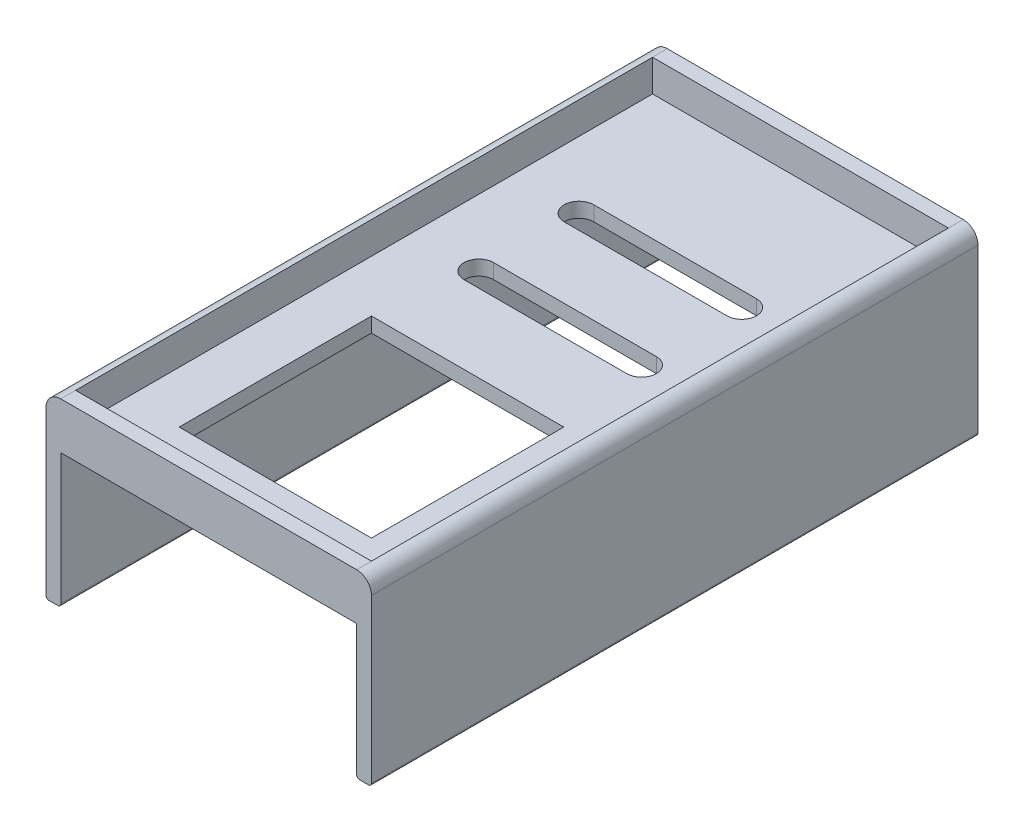
ISO-10303-21;
HEADER;
FILE_DESCRIPTION(('STEP AP214'),'2;1');
FILE_NAME('part.step','',(''),(''),'','','');
FILE_SCHEMA(('AUTOMOTIVE_DESIGN { 1 0 10303 214 1 1 1 1 }'));
ENDSEC;
DATA;
#1=APPLICATION_CONTEXT('core data for automotive mechanical design processes');
#2=APPLICATION_PROTOCOL_DEFINITION('international standard','automotive_design',2000,#1);
#3=PRODUCT_CONTEXT('',#1,'mechanical');
#4=PRODUCT('Part','Part','',(#3));
#5=PRODUCT_RELATED_PRODUCT_CATEGORY('part','',(#4));
#6=PRODUCT_DEFINITION_FORMATION('','',#4);
#7=PRODUCT_DEFINITION_CONTEXT('part definition',#1,'design');
#8=PRODUCT_DEFINITION('design','',#6,#7);
#9=PRODUCT_DEFINITION_SHAPE('','',#8);
#10=(LENGTH_UNIT() NAMED_UNIT(*) SI_UNIT(.MILLI.,.METRE.));
#11=(NAMED_UNIT(*) PLANE_ANGLE_UNIT() SI_UNIT($,.RADIAN.));
#12=(NAMED_UNIT(*) SI_UNIT($,.STERADIAN.) SOLID_ANGLE_UNIT());
#13=UNCERTAINTY_MEASURE_WITH_UNIT(LENGTH_MEASURE(1.E-05),#10,'distance_accuracy_value','');
#14=(GEOMETRIC_REPRESENTATION_CONTEXT(3) GLOBAL_UNCERTAINTY_ASSIGNED_CONTEXT((#13)) GLOBAL_UNIT_ASSIGNED_CONTEXT((#10,
#11,#12)) REPRESENTATION_CONTEXT('',''));
#15=CARTESIAN_POINT('',(0.,0.,0.));
#16=DIRECTION('',(0.,0.,1.));
#17=DIRECTION('',(1.,0.,0.));
#18=AXIS2_PLACEMENT_3D('',#15,#16,#17);
#19=CARTESIAN_POINT('',(-76.0997442455243,40.6521739130435,-410.));
#20=DIRECTION('',(0.,1.,0.));
#21=DIRECTION('',(0.,0.,1.));
#22=AXIS2_PLACEMENT_3D('',#19,#20,#21);
#23=PLANE('',#22);
#24=DIRECTION('',(0.,0.,1.));
#25=VECTOR('',#24,1.);
#26=CARTESIAN_POINT('',(133.900255754476,40.6521739130435,-600.));
#27=LINE('',#26,#25);
#28=CARTESIAN_POINT('',(133.900255754476,40.6521739130435,-410.));
#29=VERTEX_POINT('',#28);
#30=CARTESIAN_POINT('',(133.900255754476,40.6521739130435,-400.));
#31=VERTEX_POINT('',#30);
#32=EDGE_CURVE('E439',#29,#31,#27,.T.);
#33=ORIENTED_EDGE('',*,*,#32,.F.);
#34=DIRECTION('',(-1.,0.,0.));
#35=VECTOR('',#34,1.);
#36=CARTESIAN_POINT('',(-76.0997442455243,40.6521739130435,-410.));
#37=LINE('',#36,#35);
#38=CARTESIAN_POINT('',(-66.0997442455242,40.6521739130435,-410.));
#39=VERTEX_POINT('',#38);
#40=EDGE_CURVE('E277',#29,#39,#37,.T.);
#41=ORIENTED_EDGE('',*,*,#40,.T.);
#42=DIRECTION('',(0.,0.,1.));
#43=VECTOR('',#42,1.);
#44=CARTESIAN_POINT('',(-66.0997442455242,40.6521739130435,-600.));
#45=LINE('',#44,#43);
#46=CARTESIAN_POINT('',(-66.0997442455242,40.6521739130435,-400.));
#47=VERTEX_POINT('',#46);
#48=EDGE_CURVE('E438',#39,#47,#45,.T.);
#49=ORIENTED_EDGE('',*,*,#48,.T.);
#50=DIRECTION('',(1.,0.,0.));
#51=VECTOR('',#50,1.);
#52=CARTESIAN_POINT('',(0.,40.6521739130435,-400.));
#53=LINE('',#52,#51);
#54=EDGE_CURVE('E403',#47,#31,#53,.T.);
#55=ORIENTED_EDGE('',*,*,#54,.T.);
#56=EDGE_LOOP('',(#33,#41,#49,#55));
#57=FACE_BOUND('',#56,.T.);
#58=ADVANCED_FACE('F33',(#57),#23,.T.);
#59=CARTESIAN_POINT('',(-76.0997442455243,40.6521739130435,-410.));
#60=DIRECTION('',(-1.,0.,0.));
#61=DIRECTION('',(0.,-1.,0.));
#62=AXIS2_PLACEMENT_3D('',#59,#60,#61);
#63=PLANE('',#62);
#64=DIRECTION('',(0.,-1.,0.));
#65=VECTOR('',#64,1.);
#66=CARTESIAN_POINT('',(-76.0997442455243,40.6521739130435,-410.));
#67=LINE('',#66,#65);
#68=CARTESIAN_POINT('',(-76.0997442455243,30.6521739130434,-410.));
#69=VERTEX_POINT('',#68);
#70=CARTESIAN_POINT('',(-76.0997442455243,-79.3478260869565,-410.));
#71=VERTEX_POINT('',#70);
#72=EDGE_CURVE('E272',#69,#71,#67,.T.);
#73=ORIENTED_EDGE('',*,*,#72,.T.);
#74=DIRECTION('',(0.,0.,1.));
#75=VECTOR('',#74,1.);
#76=CARTESIAN_POINT('',(-76.0997442455243,-79.3478260869565,-600.));
#77=LINE('',#76,#75);
#78=CARTESIAN_POINT('',(-76.0997442455243,-79.3478260869565,0.));
#79=VERTEX_POINT('',#78);
#80=EDGE_CURVE('E493',#71,#79,#77,.T.);
#81=ORIENTED_EDGE('',*,*,#80,.T.);
#82=DIRECTION('',(0.,-1.,0.));
#83=VECTOR('',#82,1.);
#84=CARTESIAN_POINT('',(-76.0997442455243,40.6521739130435,0.));
#85=LINE('',#84,#83);
#86=CARTESIAN_POINT('',(-76.0997442455243,30.6521739130434,0.));
#87=VERTEX_POINT('',#86);
#88=EDGE_CURVE('E256',#87,#79,#85,.T.);
#89=ORIENTED_EDGE('',*,*,#88,.F.);
#90=DIRECTION('',(0.,0.,1.));
#91=VECTOR('',#90,1.);
#92=CARTESIAN_POINT('',(-76.0997442455243,30.6521739130434,-600.));
#93=LINE('',#92,#91);
#94=EDGE_CURVE('E467',#69,#87,#93,.T.);
#95=ORIENTED_EDGE('',*,*,#94,.F.);
#96=EDGE_LOOP('',(#73,#81,#89,#95));
#97=FACE_BOUND('',#96,.T.);
#98=ADVANCED_FACE('F35',(#97),#63,.T.);
#99=CARTESIAN_POINT('',(143.900255754476,40.6521739130435,-410.));
#100=DIRECTION('',(1.,0.,0.));
#101=DIRECTION('',(0.,1.,0.));
#102=AXIS2_PLACEMENT_3D('',#99,#100,#101);
#103=PLANE('',#102);
#104=DIRECTION('',(0.,0.,1.));
#105=VECTOR('',#104,1.);
#106=CARTESIAN_POINT('',(143.900255754476,-79.3478260869565,-600.));
#107=LINE('',#106,#105);
#108=CARTESIAN_POINT('',(143.900255754476,-79.3478260869565,-410.));
#109=VERTEX_POINT('',#108);
#110=CARTESIAN_POINT('',(143.900255754476,-79.3478260869565,0.));
#111=VERTEX_POINT('',#110);
#112=EDGE_CURVE('E470',#109,#111,#107,.T.);
#113=ORIENTED_EDGE('',*,*,#112,.F.);
#114=DIRECTION('',(0.,1.,0.));
#115=VECTOR('',#114,1.);
#116=CARTESIAN_POINT('',(143.900255754476,40.6521739130435,-410.));
#117=LINE('',#116,#115);
#118=CARTESIAN_POINT('',(143.900255754476,30.6521739130434,-410.));
#119=VERTEX_POINT('',#118);
#120=EDGE_CURVE('E431',#109,#119,#117,.T.);
#121=ORIENTED_EDGE('',*,*,#120,.T.);
#122=DIRECTION('',(0.,0.,1.));
#123=VECTOR('',#122,1.);
#124=CARTESIAN_POINT('',(143.900255754476,30.6521739130434,-600.));
#125=LINE('',#124,#123);
#126=CARTESIAN_POINT('',(143.900255754476,30.6521739130434,0.));
#127=VERTEX_POINT('',#126);
#128=EDGE_CURVE('E477',#119,#127,#125,.T.);
#129=ORIENTED_EDGE('',*,*,#128,.T.);
#130=DIRECTION('',(0.,1.,0.));
#131=VECTOR('',#130,1.);
#132=CARTESIAN_POINT('',(143.900255754476,40.6521739130435,0.));
#133=LINE('',#132,#131);
#134=EDGE_CURVE('E266',#111,#127,#133,.T.);
#135=ORIENTED_EDGE('',*,*,#134,.F.);
#136=EDGE_LOOP('',(#113,#121,#129,#135));
#137=FACE_BOUND('',#136,.T.);
#138=ADVANCED_FACE('F472',(#137),#103,.T.);
#139=CARTESIAN_POINT('',(0.,0.,-410.));
#140=DIRECTION('',(0.,0.,1.));
#141=DIRECTION('',(1.,0.,0.));
#142=AXIS2_PLACEMENT_3D('',#139,#140,#141);
#143=PLANE('',#142);
#144=CARTESIAN_POINT('',(-74.0997442455243,-79.3478260869565,-410.));
#145=DIRECTION('',(0.,0.,1.));
#146=DIRECTION('',(1.,0.,0.));
#147=AXIS2_PLACEMENT_3D('',#144,#145,#146);
#148=CIRCLE('',#147,2.);
#149=CARTESIAN_POINT('',(-74.0997442455243,-81.3478260869565,-410.));
#150=VERTEX_POINT('',#149);
#151=EDGE_CURVE('E461',#71,#150,#148,.T.);
#152=ORIENTED_EDGE('',*,*,#151,.F.);
#153=ORIENTED_EDGE('',*,*,#72,.F.);
#154=CARTESIAN_POINT('',(-66.0997442455243,30.6521739130435,-410.));
#155=DIRECTION('',(0.,0.,1.));
#156=DIRECTION('',(1.,0.,0.));
#157=AXIS2_PLACEMENT_3D('',#154,#155,#156);
#158=CIRCLE('',#157,10.);
#159=EDGE_CURVE('E448',#69,#39,#158,.F.);
#160=ORIENTED_EDGE('',*,*,#159,.T.);
#161=ORIENTED_EDGE('',*,*,#40,.F.);
#162=CARTESIAN_POINT('',(133.900255754476,30.6521739130435,-410.));
#163=DIRECTION('',(0.,0.,1.));
#164=DIRECTION('',(1.,0.,0.));
#165=AXIS2_PLACEMENT_3D('',#162,#163,#164);
#166=CIRCLE('',#165,10.);
#167=EDGE_CURVE('E446',#119,#29,#166,.T.);
#168=ORIENTED_EDGE('',*,*,#167,.F.);
#169=ORIENTED_EDGE('',*,*,#120,.F.);
#170=CARTESIAN_POINT('',(141.900255754476,-79.3478260869565,-410.));
#171=DIRECTION('',(0.,0.,1.));
#172=DIRECTION('',(1.,0.,0.));
#173=AXIS2_PLACEMENT_3D('',#170,#171,#172);
#174=CIRCLE('',#173,2.);
#175=CARTESIAN_POINT('',(141.900255754476,-81.3478260869565,-410.));
#176=VERTEX_POINT('',#175);
#177=EDGE_CURVE('E453',#176,#109,#174,.T.);
#178=ORIENTED_EDGE('',*,*,#177,.F.);
#179=DIRECTION('',(1.,0.,0.));
#180=VECTOR('',#179,1.);
#181=CARTESIAN_POINT('',(143.900255754476,-81.3478260869565,-410.));
#182=LINE('',#181,#180);
#183=CARTESIAN_POINT('',(135.900255754476,-81.3478260869565,-410.));
#184=VERTEX_POINT('',#183);
#185=EDGE_CURVE('E287',#184,#176,#182,.T.);
#186=ORIENTED_EDGE('',*,*,#185,.F.);
#187=CARTESIAN_POINT('',(135.900255754476,-79.3478260869565,-410.));
#188=DIRECTION('',(0.,0.,1.));
#189=DIRECTION('',(1.,0.,0.));
#190=AXIS2_PLACEMENT_3D('',#187,#188,#189);
#191=CIRCLE('',#190,2.);
#192=CARTESIAN_POINT('',(133.900255754476,-79.3478260869565,-410.));
#193=VERTEX_POINT('',#192);
#194=EDGE_CURVE('E48',#184,#193,#191,.F.);
#195=ORIENTED_EDGE('',*,*,#194,.T.);
#196=DIRECTION('',(0.,-1.,0.));
#197=VECTOR('',#196,1.);
#198=CARTESIAN_POINT('',(133.900255754476,-79.3478260869565,-410.));
#199=LINE('',#198,#197);
#200=CARTESIAN_POINT('',(133.900255754476,9.15217391304349,-410.));
#201=VERTEX_POINT('',#200);
#202=EDGE_CURVE('E428',#201,#193,#199,.T.);
#203=ORIENTED_EDGE('',*,*,#202,.F.);
#204=DIRECTION('',(1.,0.,0.));
#205=VECTOR('',#204,1.);
#206=CARTESIAN_POINT('',(133.900255754476,9.15217391304349,-410.));
#207=LINE('',#206,#205);
#208=CARTESIAN_POINT('',(-66.0997442455243,9.15217391304349,-410.));
#209=VERTEX_POINT('',#208);
#210=EDGE_CURVE('E425',#209,#201,#207,.T.);
#211=ORIENTED_EDGE('',*,*,#210,.F.);
#212=DIRECTION('',(0.,1.,0.));
#213=VECTOR('',#212,1.);
#214=CARTESIAN_POINT('',(-66.0997442455243,-79.3478260869565,-410.));
#215=LINE('',#214,#213);
#216=CARTESIAN_POINT('',(-66.0997442455243,-79.3478260869565,-410.));
#217=VERTEX_POINT('',#216);
#218=EDGE_CURVE('E423',#217,#209,#215,.T.);
#219=ORIENTED_EDGE('',*,*,#218,.F.);
#220=CARTESIAN_POINT('',(-68.0997442455243,-79.3478260869565,-410.));
#221=DIRECTION('',(0.,0.,1.));
#222=DIRECTION('',(1.,0.,0.));
#223=AXIS2_PLACEMENT_3D('',#220,#221,#222);
#224=CIRCLE('',#223,2.);
#225=CARTESIAN_POINT('',(-68.0997442455243,-81.3478260869565,-410.));
#226=VERTEX_POINT('',#225);
#227=EDGE_CURVE('E234',#226,#217,#224,.T.);
#228=ORIENTED_EDGE('',*,*,#227,.F.);
#229=DIRECTION('',(1.,0.,0.));
#230=VECTOR('',#229,1.);
#231=CARTESIAN_POINT('',(-66.0997442455243,-81.3478260869565,-410.));
#232=LINE('',#231,#230);
#233=EDGE_CURVE('E292',#150,#226,#232,.T.);
#234=ORIENTED_EDGE('',*,*,#233,.F.);
#235=EDGE_LOOP('',(#152,#153,#160,#161,#168,#169,#178,#186,#195,#203,#211,#219,#228,#234));
#236=FACE_BOUND('',#235,.T.);
#237=ADVANCED_FACE('F444',(#236),#143,.F.);
#238=CARTESIAN_POINT('',(0.,0.,0.));
#239=DIRECTION('',(0.,0.,1.));
#240=DIRECTION('',(1.,0.,0.));
#241=AXIS2_PLACEMENT_3D('',#238,#239,#240);
#242=PLANE('',#241);
#243=ORIENTED_EDGE('',*,*,#88,.T.);
#244=CARTESIAN_POINT('',(-74.0997442455243,-79.3478260869565,0.));
#245=DIRECTION('',(0.,0.,1.));
#246=DIRECTION('',(1.,0.,0.));
#247=AXIS2_PLACEMENT_3D('',#244,#245,#246);
#248=CIRCLE('',#247,2.);
#249=CARTESIAN_POINT('',(-74.0997442455243,-81.3478260869565,0.));
#250=VERTEX_POINT('',#249);
#251=EDGE_CURVE('E238',#79,#250,#248,.T.);
#252=ORIENTED_EDGE('',*,*,#251,.T.);
#253=DIRECTION('',(-1.,0.,0.));
#254=VECTOR('',#253,1.);
#255=CARTESIAN_POINT('',(-66.0997442455243,-81.3478260869565,0.));
#256=LINE('',#255,#254);
#257=CARTESIAN_POINT('',(-68.0997442455243,-81.3478260869565,0.));
#258=VERTEX_POINT('',#257);
#259=EDGE_CURVE('E249',#258,#250,#256,.T.);
#260=ORIENTED_EDGE('',*,*,#259,.F.);
#261=CARTESIAN_POINT('',(-68.0997442455243,-79.3478260869565,0.));
#262=DIRECTION('',(0.,0.,1.));
#263=DIRECTION('',(1.,0.,0.));
#264=AXIS2_PLACEMENT_3D('',#261,#262,#263);
#265=CIRCLE('',#264,2.);
#266=CARTESIAN_POINT('',(-66.0997442455243,-79.3478260869565,0.));
#267=VERTEX_POINT('',#266);
#268=EDGE_CURVE('E231',#258,#267,#265,.T.);
#269=ORIENTED_EDGE('',*,*,#268,.T.);
#270=DIRECTION('',(0.,1.,0.));
#271=VECTOR('',#270,1.);
#272=CARTESIAN_POINT('',(-66.0997442455243,-79.3478260869565,0.));
#273=LINE('',#272,#271);
#274=CARTESIAN_POINT('',(-66.0997442455243,9.15217391304349,0.));
#275=VERTEX_POINT('',#274);
#276=EDGE_CURVE('E245',#267,#275,#273,.T.);
#277=ORIENTED_EDGE('',*,*,#276,.T.);
#278=DIRECTION('',(1.,0.,0.));
#279=VECTOR('',#278,1.);
#280=CARTESIAN_POINT('',(133.900255754476,9.15217391304349,0.));
#281=LINE('',#280,#279);
#282=CARTESIAN_POINT('',(133.900255754476,9.15217391304349,0.));
#283=VERTEX_POINT('',#282);
#284=EDGE_CURVE('E255',#275,#283,#281,.T.);
#285=ORIENTED_EDGE('',*,*,#284,.T.);
#286=DIRECTION('',(0.,-1.,0.));
#287=VECTOR('',#286,1.);
#288=CARTESIAN_POINT('',(133.900255754476,-79.3478260869565,0.));
#289=LINE('',#288,#287);
#290=CARTESIAN_POINT('',(133.900255754476,-79.3478260869565,0.));
#291=VERTEX_POINT('',#290);
#292=EDGE_CURVE('E258',#283,#291,#289,.T.);
#293=ORIENTED_EDGE('',*,*,#292,.T.);
#294=CARTESIAN_POINT('',(135.900255754476,-79.3478260869565,0.));
#295=DIRECTION('',(0.,0.,1.));
#296=DIRECTION('',(1.,0.,0.));
#297=AXIS2_PLACEMENT_3D('',#294,#295,#296);
#298=CIRCLE('',#297,2.);
#299=CARTESIAN_POINT('',(135.900255754476,-81.3478260869565,0.));
#300=VERTEX_POINT('',#299);
#301=EDGE_CURVE('E291',#300,#291,#298,.F.);
#302=ORIENTED_EDGE('',*,*,#301,.F.);
#303=DIRECTION('',(-1.,0.,0.));
#304=VECTOR('',#303,1.);
#305=CARTESIAN_POINT('',(143.900255754476,-81.3478260869565,0.));
#306=LINE('',#305,#304);
#307=CARTESIAN_POINT('',(141.900255754476,-81.3478260869565,0.));
#308=VERTEX_POINT('',#307);
#309=EDGE_CURVE('E285',#308,#300,#306,.T.);
#310=ORIENTED_EDGE('',*,*,#309,.F.);
#311=CARTESIAN_POINT('',(141.900255754476,-79.3478260869565,0.));
#312=DIRECTION('',(0.,0.,1.));
#313=DIRECTION('',(1.,0.,0.));
#314=AXIS2_PLACEMENT_3D('',#311,#312,#313);
#315=CIRCLE('',#314,2.);
#316=EDGE_CURVE('E55',#308,#111,#315,.T.);
#317=ORIENTED_EDGE('',*,*,#316,.T.);
#318=ORIENTED_EDGE('',*,*,#134,.T.);
#319=CARTESIAN_POINT('',(133.900255754476,30.6521739130435,0.));
#320=DIRECTION('',(0.,0.,1.));
#321=DIRECTION('',(1.,0.,0.));
#322=AXIS2_PLACEMENT_3D('',#319,#320,#321);
#323=CIRCLE('',#322,10.);
#324=CARTESIAN_POINT('',(133.900255754476,40.6521739130435,0.));
#325=VERTEX_POINT('',#324);
#326=EDGE_CURVE('E474',#127,#325,#323,.T.);
#327=ORIENTED_EDGE('',*,*,#326,.T.);
#328=DIRECTION('',(-1.,0.,0.));
#329=VECTOR('',#328,1.);
#330=CARTESIAN_POINT('',(-76.0997442455243,40.6521739130435,0.));
#331=LINE('',#330,#329);
#332=CARTESIAN_POINT('',(-66.0997442455242,40.6521739130435,0.));
#333=VERTEX_POINT('',#332);
#334=EDGE_CURVE('E269',#325,#333,#331,.T.);
#335=ORIENTED_EDGE('',*,*,#334,.T.);
#336=CARTESIAN_POINT('',(-66.0997442455243,30.6521739130435,0.));
#337=DIRECTION('',(0.,0.,1.));
#338=DIRECTION('',(1.,0.,0.));
#339=AXIS2_PLACEMENT_3D('',#336,#337,#338);
#340=CIRCLE('',#339,10.);
#341=EDGE_CURVE('E483',#87,#333,#340,.F.);
#342=ORIENTED_EDGE('',*,*,#341,.F.);
#343=EDGE_LOOP('',(#243,#252,#260,#269,#277,#285,#293,#302,#310,#317,#318,#327,#335,#342));
#344=FACE_BOUND('',#343,.T.);
#345=ADVANCED_FACE('F243',(#344),#242,.T.);
#346=CARTESIAN_POINT('',(0.,-81.3478260869565,0.));
#347=DIRECTION('',(0.,-1.,0.));
#348=DIRECTION('',(0.,0.,-1.));
#349=AXIS2_PLACEMENT_3D('',#346,#347,#348);
#350=PLANE('',#349);
#351=ORIENTED_EDGE('',*,*,#309,.T.);
#352=DIRECTION('',(0.,0.,1.));
#353=VECTOR('',#352,1.);
#354=CARTESIAN_POINT('',(135.900255754476,-81.3478260869565,-600.));
#355=LINE('',#354,#353);
#356=EDGE_CURVE('E11',#300,#184,#355,.F.);
#357=ORIENTED_EDGE('',*,*,#356,.T.);
#358=ORIENTED_EDGE('',*,*,#185,.T.);
#359=DIRECTION('',(0.,0.,1.));
#360=VECTOR('',#359,1.);
#361=CARTESIAN_POINT('',(141.900255754476,-81.3478260869565,-600.));
#362=LINE('',#361,#360);
#363=EDGE_CURVE('E41',#176,#308,#362,.T.);
#364=ORIENTED_EDGE('',*,*,#363,.T.);
#365=EDGE_LOOP('',(#351,#357,#358,#364));
#366=FACE_BOUND('',#365,.T.);
#367=ADVANCED_FACE('F284',(#366),#350,.T.);
#368=CARTESIAN_POINT('',(0.,-81.3478260869565,0.));
#369=DIRECTION('',(0.,-1.,0.));
#370=DIRECTION('',(0.,0.,-1.));
#371=AXIS2_PLACEMENT_3D('',#368,#369,#370);
#372=PLANE('',#371);
#373=DIRECTION('',(0.,0.,1.));
#374=VECTOR('',#373,1.);
#375=CARTESIAN_POINT('',(-74.0997442455243,-81.3478260869565,-600.));
#376=LINE('',#375,#374);
#377=EDGE_CURVE('E279',#150,#250,#376,.T.);
#378=ORIENTED_EDGE('',*,*,#377,.F.);
#379=ORIENTED_EDGE('',*,*,#233,.T.);
#380=DIRECTION('',(0.,0.,1.));
#381=VECTOR('',#380,1.);
#382=CARTESIAN_POINT('',(-68.0997442455243,-81.3478260869565,-600.));
#383=LINE('',#382,#381);
#384=EDGE_CURVE('E275',#226,#258,#383,.T.);
#385=ORIENTED_EDGE('',*,*,#384,.T.);
#386=ORIENTED_EDGE('',*,*,#259,.T.);
#387=EDGE_LOOP('',(#378,#379,#385,#386));
#388=FACE_BOUND('',#387,.T.);
#389=ADVANCED_FACE('F458',(#388),#372,.T.);
#390=CARTESIAN_POINT('',(133.900255754476,40.6521739130435,-10.));
#391=VERTEX_POINT('',#390);
#392=EDGE_CURVE('E500',#391,#325,#27,.T.);
#393=ORIENTED_EDGE('',*,*,#392,.F.);
#394=DIRECTION('',(1.,0.,0.));
#395=VECTOR('',#394,1.);
#396=CARTESIAN_POINT('',(0.,40.6521739130435,-9.99999999999997));
#397=LINE('',#396,#395);
#398=CARTESIAN_POINT('',(-66.0997442455243,40.6521739130435,-9.99999999999997));
#399=VERTEX_POINT('',#398);
#400=EDGE_CURVE('E393',#399,#391,#397,.T.);
#401=ORIENTED_EDGE('',*,*,#400,.F.);
#402=EDGE_CURVE('E464',#399,#333,#45,.T.);
#403=ORIENTED_EDGE('',*,*,#402,.T.);
#404=ORIENTED_EDGE('',*,*,#334,.F.);
#405=EDGE_LOOP('',(#393,#401,#403,#404));
#406=FACE_BOUND('',#405,.T.);
#407=ADVANCED_FACE('F503',(#406),#23,.T.);
#408=CARTESIAN_POINT('',(133.900255754476,-79.3478260869565,-410.));
#409=DIRECTION('',(-1.,0.,0.));
#410=DIRECTION('',(0.,0.,1.));
#411=AXIS2_PLACEMENT_3D('',#408,#409,#410);
#412=PLANE('',#411);
#413=DIRECTION('',(0.,0.,1.));
#414=VECTOR('',#413,1.);
#415=CARTESIAN_POINT('',(133.900255754476,-79.3478260869565,-600.));
#416=LINE('',#415,#414);
#417=EDGE_CURVE('E479',#193,#291,#416,.T.);
#418=ORIENTED_EDGE('',*,*,#417,.T.);
#419=ORIENTED_EDGE('',*,*,#292,.F.);
#420=DIRECTION('',(0.,0.,1.));
#421=VECTOR('',#420,1.);
#422=CARTESIAN_POINT('',(133.900255754476,9.15217391304349,-410.));
#423=LINE('',#422,#421);
#424=EDGE_CURVE('E273',#201,#283,#423,.T.);
#425=ORIENTED_EDGE('',*,*,#424,.F.);
#426=ORIENTED_EDGE('',*,*,#202,.T.);
#427=EDGE_LOOP('',(#418,#419,#425,#426));
#428=FACE_BOUND('',#427,.T.);
#429=ADVANCED_FACE('F546',(#428),#412,.T.);
#430=CARTESIAN_POINT('',(133.900255754476,9.15217391304349,-410.));
#431=DIRECTION('',(0.,-1.,0.));
#432=DIRECTION('',(0.,0.,-1.));
#433=AXIS2_PLACEMENT_3D('',#430,#431,#432);
#434=PLANE('',#433);
#435=DIRECTION('',(-1.,0.,0.));
#436=VECTOR('',#435,1.);
#437=CARTESIAN_POINT('',(133.900255754476,9.15217391304349,-45.));
#438=LINE('',#437,#436);
#439=CARTESIAN_POINT('',(98.9002557544757,9.15217391304349,-45.));
#440=VERTEX_POINT('',#439);
#441=CARTESIAN_POINT('',(-31.0997442455243,9.15217391304349,-45.));
#442=VERTEX_POINT('',#441);
#443=EDGE_CURVE('E387',#440,#442,#438,.T.);
#444=ORIENTED_EDGE('',*,*,#443,.F.);
#445=DIRECTION('',(0.,0.,-1.));
#446=VECTOR('',#445,1.);
#447=CARTESIAN_POINT('',(98.9002557544757,9.15217391304349,-410.));
#448=LINE('',#447,#446);
#449=CARTESIAN_POINT('',(98.9002557544757,9.15217391304349,-175.));
#450=VERTEX_POINT('',#449);
#451=EDGE_CURVE('E379',#440,#450,#448,.T.);
#452=ORIENTED_EDGE('',*,*,#451,.T.);
#453=DIRECTION('',(-1.,0.,0.));
#454=VECTOR('',#453,1.);
#455=CARTESIAN_POINT('',(133.900255754476,9.15217391304349,-175.));
#456=LINE('',#455,#454);
#457=CARTESIAN_POINT('',(-31.0997442455243,9.15217391304349,-175.));
#458=VERTEX_POINT('',#457);
#459=EDGE_CURVE('E382',#450,#458,#456,.T.);
#460=ORIENTED_EDGE('',*,*,#459,.T.);
#461=DIRECTION('',(0.,0.,-1.));
#462=VECTOR('',#461,1.);
#463=CARTESIAN_POINT('',(-31.0997442455243,9.15217391304349,-410.));
#464=LINE('',#463,#462);
#465=EDGE_CURVE('E385',#442,#458,#464,.T.);
#466=ORIENTED_EDGE('',*,*,#465,.F.);
#467=EDGE_LOOP('',(#444,#452,#460,#466));
#468=FACE_BOUND('',#467,.T.);
#469=CARTESIAN_POINT('',(-21.0997442455243,9.15217391304349,-237.552781264335));
#470=DIRECTION('',(0.,-1.,0.));
#471=DIRECTION('',(0.,0.,-1.));
#472=AXIS2_PLACEMENT_3D('',#469,#470,#471);
#473=CIRCLE('',#472,10.);
#474=CARTESIAN_POINT('',(-21.0997442455243,9.15217391304349,-227.552781264335));
#475=VERTEX_POINT('',#474);
#476=CARTESIAN_POINT('',(-21.0997442455243,9.15217391304349,-247.552781264335));
#477=VERTEX_POINT('',#476);
#478=EDGE_CURVE('E377',#475,#477,#473,.T.);
#479=ORIENTED_EDGE('',*,*,#478,.F.);
#480=DIRECTION('',(-1.,0.,0.));
#481=VECTOR('',#480,1.);
#482=CARTESIAN_POINT('',(133.900255754476,9.15217391304349,-227.552781264335));
#483=LINE('',#482,#481);
#484=CARTESIAN_POINT('',(88.9002557544757,9.15217391304349,-227.552781264335));
#485=VERTEX_POINT('',#484);
#486=EDGE_CURVE('E369',#485,#475,#483,.T.);
#487=ORIENTED_EDGE('',*,*,#486,.F.);
#488=CARTESIAN_POINT('',(88.9002557544757,9.15217391304349,-237.552781264335));
#489=DIRECTION('',(0.,-1.,0.));
#490=DIRECTION('',(0.,0.,-1.));
#491=AXIS2_PLACEMENT_3D('',#488,#489,#490);
#492=CIRCLE('',#491,10.);
#493=CARTESIAN_POINT('',(88.9002557544757,9.15217391304349,-247.552781264335));
#494=VERTEX_POINT('',#493);
#495=EDGE_CURVE('E371',#494,#485,#492,.T.);
#496=ORIENTED_EDGE('',*,*,#495,.F.);
#497=DIRECTION('',(-1.,0.,0.));
#498=VECTOR('',#497,1.);
#499=CARTESIAN_POINT('',(133.900255754476,9.15217391304349,-247.552781264335));
#500=LINE('',#499,#498);
#501=EDGE_CURVE('E374',#494,#477,#500,.T.);
#502=ORIENTED_EDGE('',*,*,#501,.T.);
#503=EDGE_LOOP('',(#479,#487,#496,#502));
#504=FACE_BOUND('',#503,.T.);
#505=CARTESIAN_POINT('',(-21.0997442455243,9.15217391304349,-305.266550996848));
#506=DIRECTION('',(0.,-1.,0.));
#507=DIRECTION('',(0.,0.,-1.));
#508=AXIS2_PLACEMENT_3D('',#505,#506,#507);
#509=CIRCLE('',#508,10.);
#510=CARTESIAN_POINT('',(-21.0997442455243,9.15217391304349,-295.266550996848));
#511=VERTEX_POINT('',#510);
#512=CARTESIAN_POINT('',(-21.0997442455243,9.15217391304349,-315.266550996848));
#513=VERTEX_POINT('',#512);
#514=EDGE_CURVE('E367',#511,#513,#509,.T.);
#515=ORIENTED_EDGE('',*,*,#514,.F.);
#516=DIRECTION('',(-1.,0.,0.));
#517=VECTOR('',#516,1.);
#518=CARTESIAN_POINT('',(133.900255754476,9.15217391304349,-295.266550996848));
#519=LINE('',#518,#517);
#520=CARTESIAN_POINT('',(88.9002557544757,9.15217391304349,-295.266550996848));
#521=VERTEX_POINT('',#520);
#522=EDGE_CURVE('E315',#521,#511,#519,.T.);
#523=ORIENTED_EDGE('',*,*,#522,.F.);
#524=CARTESIAN_POINT('',(88.9002557544757,9.15217391304349,-305.266550996848));
#525=DIRECTION('',(0.,-1.,0.));
#526=DIRECTION('',(0.,0.,-1.));
#527=AXIS2_PLACEMENT_3D('',#524,#525,#526);
#528=CIRCLE('',#527,10.);
#529=CARTESIAN_POINT('',(88.9002557544757,9.15217391304349,-315.266550996848));
#530=VERTEX_POINT('',#529);
#531=EDGE_CURVE('E361',#530,#521,#528,.T.);
#532=ORIENTED_EDGE('',*,*,#531,.F.);
#533=DIRECTION('',(-1.,0.,0.));
#534=VECTOR('',#533,1.);
#535=CARTESIAN_POINT('',(133.900255754476,9.15217391304349,-315.266550996848));
#536=LINE('',#535,#534);
#537=EDGE_CURVE('E364',#530,#513,#536,.T.);
#538=ORIENTED_EDGE('',*,*,#537,.T.);
#539=EDGE_LOOP('',(#515,#523,#532,#538));
#540=FACE_BOUND('',#539,.T.);
#541=ORIENTED_EDGE('',*,*,#284,.F.);
#542=DIRECTION('',(0.,0.,1.));
#543=VECTOR('',#542,1.);
#544=CARTESIAN_POINT('',(-66.0997442455243,9.15217391304349,-410.));
#545=LINE('',#544,#543);
#546=EDGE_CURVE('E253',#209,#275,#545,.T.);
#547=ORIENTED_EDGE('',*,*,#546,.F.);
#548=ORIENTED_EDGE('',*,*,#210,.T.);
#549=ORIENTED_EDGE('',*,*,#424,.T.);
#550=EDGE_LOOP('',(#541,#547,#548,#549));
#551=FACE_BOUND('',#550,.T.);
#552=ADVANCED_FACE('F551',(#468,#504,#540,#551),#434,.T.);
#553=CARTESIAN_POINT('',(-66.0997442455243,-79.3478260869565,-410.));
#554=DIRECTION('',(1.,0.,0.));
#555=DIRECTION('',(0.,0.,-1.));
#556=AXIS2_PLACEMENT_3D('',#553,#554,#555);
#557=PLANE('',#556);
#558=DIRECTION('',(0.,0.,1.));
#559=VECTOR('',#558,1.);
#560=CARTESIAN_POINT('',(-66.0997442455243,-79.3478260869565,-600.));
#561=LINE('',#560,#559);
#562=EDGE_CURVE('E228',#217,#267,#561,.T.);
#563=ORIENTED_EDGE('',*,*,#562,.F.);
#564=ORIENTED_EDGE('',*,*,#218,.T.);
#565=ORIENTED_EDGE('',*,*,#546,.T.);
#566=ORIENTED_EDGE('',*,*,#276,.F.);
#567=EDGE_LOOP('',(#563,#564,#565,#566));
#568=FACE_BOUND('',#567,.T.);
#569=ADVANCED_FACE('F251',(#568),#557,.T.);
#570=CARTESIAN_POINT('',(133.900255754476,19.1521739130435,0.));
#571=DIRECTION('',(-1.,0.,0.));
#572=DIRECTION('',(0.,0.,1.));
#573=AXIS2_PLACEMENT_3D('',#570,#571,#572);
#574=PLANE('',#573);
#575=DIRECTION('',(0.,0.,1.));
#576=VECTOR('',#575,1.);
#577=CARTESIAN_POINT('',(133.900255754476,40.6521739130435,0.));
#578=LINE('',#577,#576);
#579=EDGE_CURVE('E389',#31,#391,#578,.T.);
#580=ORIENTED_EDGE('',*,*,#579,.F.);
#581=DIRECTION('',(0.,1.,0.));
#582=VECTOR('',#581,1.);
#583=CARTESIAN_POINT('',(133.900255754476,19.1521739130435,-400.));
#584=LINE('',#583,#582);
#585=CARTESIAN_POINT('',(133.900255754476,19.1521739130435,-400.));
#586=VERTEX_POINT('',#585);
#587=EDGE_CURVE('E401',#586,#31,#584,.T.);
#588=ORIENTED_EDGE('',*,*,#587,.F.);
#589=DIRECTION('',(0.,0.,1.));
#590=VECTOR('',#589,1.);
#591=CARTESIAN_POINT('',(133.900255754476,19.1521739130435,0.));
#592=LINE('',#591,#590);
#593=CARTESIAN_POINT('',(133.900255754476,19.1521739130435,-9.99999999999997));
#594=VERTEX_POINT('',#593);
#595=EDGE_CURVE('E390',#586,#594,#592,.T.);
#596=ORIENTED_EDGE('',*,*,#595,.T.);
#597=DIRECTION('',(0.,1.,0.));
#598=VECTOR('',#597,1.);
#599=CARTESIAN_POINT('',(133.900255754476,19.1521739130435,-9.99999999999997));
#600=LINE('',#599,#598);
#601=EDGE_CURVE('E260',#594,#391,#600,.T.);
#602=ORIENTED_EDGE('',*,*,#601,.T.);
#603=EDGE_LOOP('',(#580,#588,#596,#602));
#604=FACE_BOUND('',#603,.T.);
#605=ADVANCED_FACE('F507',(#604),#574,.T.);
#606=CARTESIAN_POINT('',(0.,19.1521739130435,-9.99999999999997));
#607=DIRECTION('',(0.,0.,1.));
#608=DIRECTION('',(1.,0.,0.));
#609=AXIS2_PLACEMENT_3D('',#606,#607,#608);
#610=PLANE('',#609);
#611=ORIENTED_EDGE('',*,*,#400,.T.);
#612=ORIENTED_EDGE('',*,*,#601,.F.);
#613=DIRECTION('',(1.,0.,0.));
#614=VECTOR('',#613,1.);
#615=CARTESIAN_POINT('',(0.,19.1521739130435,-9.99999999999997));
#616=LINE('',#615,#614);
#617=CARTESIAN_POINT('',(-66.0997442455243,19.1521739130435,-9.99999999999997));
#618=VERTEX_POINT('',#617);
#619=EDGE_CURVE('E398',#618,#594,#616,.T.);
#620=ORIENTED_EDGE('',*,*,#619,.F.);
#621=DIRECTION('',(0.,1.,0.));
#622=VECTOR('',#621,1.);
#623=CARTESIAN_POINT('',(-66.0997442455243,19.1521739130435,-9.99999999999997));
#624=LINE('',#623,#622);
#625=EDGE_CURVE('E413',#618,#399,#624,.T.);
#626=ORIENTED_EDGE('',*,*,#625,.T.);
#627=EDGE_LOOP('',(#611,#612,#620,#626));
#628=FACE_BOUND('',#627,.T.);
#629=ADVANCED_FACE('F512',(#628),#610,.F.);
#630=CARTESIAN_POINT('',(-66.0997442455243,19.1521739130435,0.));
#631=DIRECTION('',(-1.,0.,0.));
#632=DIRECTION('',(0.,0.,1.));
#633=AXIS2_PLACEMENT_3D('',#630,#631,#632);
#634=PLANE('',#633);
#635=DIRECTION('',(0.,0.,1.));
#636=VECTOR('',#635,1.);
#637=CARTESIAN_POINT('',(-66.0997442455243,40.6521739130435,0.));
#638=LINE('',#637,#636);
#639=EDGE_CURVE('E406',#47,#399,#638,.T.);
#640=ORIENTED_EDGE('',*,*,#639,.T.);
#641=ORIENTED_EDGE('',*,*,#625,.F.);
#642=DIRECTION('',(0.,0.,1.));
#643=VECTOR('',#642,1.);
#644=CARTESIAN_POINT('',(-66.0997442455243,19.1521739130435,0.));
#645=LINE('',#644,#643);
#646=CARTESIAN_POINT('',(-66.0997442455243,19.1521739130435,-400.));
#647=VERTEX_POINT('',#646);
#648=EDGE_CURVE('E395',#647,#618,#645,.T.);
#649=ORIENTED_EDGE('',*,*,#648,.F.);
#650=DIRECTION('',(0.,1.,0.));
#651=VECTOR('',#650,1.);
#652=CARTESIAN_POINT('',(-66.0997442455243,19.1521739130435,-400.));
#653=LINE('',#652,#651);
#654=EDGE_CURVE('E416',#647,#47,#653,.T.);
#655=ORIENTED_EDGE('',*,*,#654,.T.);
#656=EDGE_LOOP('',(#640,#641,#649,#655));
#657=FACE_BOUND('',#656,.T.);
#658=ADVANCED_FACE('F515',(#657),#634,.F.);
#659=CARTESIAN_POINT('',(0.,19.1521739130435,-400.));
#660=DIRECTION('',(0.,0.,1.));
#661=DIRECTION('',(1.,0.,0.));
#662=AXIS2_PLACEMENT_3D('',#659,#660,#661);
#663=PLANE('',#662);
#664=ORIENTED_EDGE('',*,*,#54,.F.);
#665=ORIENTED_EDGE('',*,*,#654,.F.);
#666=DIRECTION('',(1.,0.,0.));
#667=VECTOR('',#666,1.);
#668=CARTESIAN_POINT('',(0.,19.1521739130435,-400.));
#669=LINE('',#668,#667);
#670=EDGE_CURVE('E392',#647,#586,#669,.T.);
#671=ORIENTED_EDGE('',*,*,#670,.T.);
#672=ORIENTED_EDGE('',*,*,#587,.T.);
#673=EDGE_LOOP('',(#664,#665,#671,#672));
#674=FACE_BOUND('',#673,.T.);
#675=ADVANCED_FACE('F519',(#674),#663,.T.);
#676=CARTESIAN_POINT('',(0.,19.1521739130435,0.));
#677=DIRECTION('',(0.,1.,0.));
#678=DIRECTION('',(0.,0.,1.));
#679=AXIS2_PLACEMENT_3D('',#676,#677,#678);
#680=PLANE('',#679);
#681=DIRECTION('',(1.,0.,0.));
#682=VECTOR('',#681,1.);
#683=CARTESIAN_POINT('',(-31.0997442455243,19.1521739130435,-45.));
#684=LINE('',#683,#682);
#685=CARTESIAN_POINT('',(-31.0997442455243,19.1521739130435,-45.));
#686=VERTEX_POINT('',#685);
#687=CARTESIAN_POINT('',(98.9002557544757,19.1521739130435,-45.));
#688=VERTEX_POINT('',#687);
#689=EDGE_CURVE('E300',#686,#688,#684,.T.);
#690=ORIENTED_EDGE('',*,*,#689,.F.);
#691=DIRECTION('',(0.,0.,1.));
#692=VECTOR('',#691,1.);
#693=CARTESIAN_POINT('',(-31.0997442455243,19.1521739130435,-175.));
#694=LINE('',#693,#692);
#695=CARTESIAN_POINT('',(-31.0997442455243,19.1521739130435,-175.));
#696=VERTEX_POINT('',#695);
#697=EDGE_CURVE('E309',#696,#686,#694,.T.);
#698=ORIENTED_EDGE('',*,*,#697,.F.);
#699=DIRECTION('',(1.,0.,0.));
#700=VECTOR('',#699,1.);
#701=CARTESIAN_POINT('',(-31.0997442455243,19.1521739130435,-175.));
#702=LINE('',#701,#700);
#703=CARTESIAN_POINT('',(98.9002557544757,19.1521739130435,-175.));
#704=VERTEX_POINT('',#703);
#705=EDGE_CURVE('E306',#696,#704,#702,.T.);
#706=ORIENTED_EDGE('',*,*,#705,.T.);
#707=DIRECTION('',(0.,0.,1.));
#708=VECTOR('',#707,1.);
#709=CARTESIAN_POINT('',(98.9002557544757,19.1521739130435,-175.));
#710=LINE('',#709,#708);
#711=EDGE_CURVE('E302',#704,#688,#710,.T.);
#712=ORIENTED_EDGE('',*,*,#711,.T.);
#713=EDGE_LOOP('',(#690,#698,#706,#712));
#714=FACE_BOUND('',#713,.T.);
#715=CARTESIAN_POINT('',(-21.0997442455243,19.1521739130435,-237.552781264335));
#716=DIRECTION('',(0.,1.,0.));
#717=DIRECTION('',(0.,0.,1.));
#718=AXIS2_PLACEMENT_3D('',#715,#716,#717);
#719=CIRCLE('',#718,10.);
#720=CARTESIAN_POINT('',(-21.0997442455243,19.1521739130435,-247.552781264335));
#721=VERTEX_POINT('',#720);
#722=CARTESIAN_POINT('',(-21.0997442455243,19.1521739130435,-227.552781264335));
#723=VERTEX_POINT('',#722);
#724=EDGE_CURVE('E303',#721,#723,#719,.T.);
#725=ORIENTED_EDGE('',*,*,#724,.F.);
#726=DIRECTION('',(1.,0.,0.));
#727=VECTOR('',#726,1.);
#728=CARTESIAN_POINT('',(-21.0997442455243,19.1521739130435,-247.552781264335));
#729=LINE('',#728,#727);
#730=CARTESIAN_POINT('',(88.9002557544757,19.1521739130435,-247.552781264335));
#731=VERTEX_POINT('',#730);
#732=EDGE_CURVE('E325',#721,#731,#729,.T.);
#733=ORIENTED_EDGE('',*,*,#732,.T.);
#734=CARTESIAN_POINT('',(88.9002557544757,19.1521739130435,-237.552781264335));
#735=DIRECTION('',(0.,1.,0.));
#736=DIRECTION('',(0.,0.,1.));
#737=AXIS2_PLACEMENT_3D('',#734,#735,#736);
#738=CIRCLE('',#737,10.);
#739=CARTESIAN_POINT('',(88.9002557544757,19.1521739130435,-227.552781264335));
#740=VERTEX_POINT('',#739);
#741=EDGE_CURVE('E335',#740,#731,#738,.T.);
#742=ORIENTED_EDGE('',*,*,#741,.F.);
#743=DIRECTION('',(1.,0.,0.));
#744=VECTOR('',#743,1.);
#745=CARTESIAN_POINT('',(-21.0997442455243,19.1521739130435,-227.552781264335));
#746=LINE('',#745,#744);
#747=EDGE_CURVE('E338',#723,#740,#746,.T.);
#748=ORIENTED_EDGE('',*,*,#747,.F.);
#749=EDGE_LOOP('',(#725,#733,#742,#748));
#750=FACE_BOUND('',#749,.T.);
#751=CARTESIAN_POINT('',(-21.0997442455243,19.1521739130435,-305.266550996848));
#752=DIRECTION('',(0.,1.,0.));
#753=DIRECTION('',(0.,0.,1.));
#754=AXIS2_PLACEMENT_3D('',#751,#752,#753);
#755=CIRCLE('',#754,10.);
#756=CARTESIAN_POINT('',(-21.0997442455243,19.1521739130435,-315.266550996848));
#757=VERTEX_POINT('',#756);
#758=CARTESIAN_POINT('',(-21.0997442455243,19.1521739130435,-295.266550996848));
#759=VERTEX_POINT('',#758);
#760=EDGE_CURVE('E332',#757,#759,#755,.T.);
#761=ORIENTED_EDGE('',*,*,#760,.F.);
#762=DIRECTION('',(1.,0.,0.));
#763=VECTOR('',#762,1.);
#764=CARTESIAN_POINT('',(-21.0997442455243,19.1521739130435,-315.266550996848));
#765=LINE('',#764,#763);
#766=CARTESIAN_POINT('',(88.9002557544757,19.1521739130435,-315.266550996848));
#767=VERTEX_POINT('',#766);
#768=EDGE_CURVE('E345',#757,#767,#765,.T.);
#769=ORIENTED_EDGE('',*,*,#768,.T.);
#770=CARTESIAN_POINT('',(88.9002557544757,19.1521739130435,-305.266550996848));
#771=DIRECTION('',(0.,1.,0.));
#772=DIRECTION('',(0.,0.,1.));
#773=AXIS2_PLACEMENT_3D('',#770,#771,#772);
#774=CIRCLE('',#773,10.);
#775=CARTESIAN_POINT('',(88.9002557544757,19.1521739130435,-295.266550996848));
#776=VERTEX_POINT('',#775);
#777=EDGE_CURVE('E353',#776,#767,#774,.T.);
#778=ORIENTED_EDGE('',*,*,#777,.F.);
#779=DIRECTION('',(1.,0.,0.));
#780=VECTOR('',#779,1.);
#781=CARTESIAN_POINT('',(-21.0997442455243,19.1521739130435,-295.266550996848));
#782=LINE('',#781,#780);
#783=EDGE_CURVE('E356',#759,#776,#782,.T.);
#784=ORIENTED_EDGE('',*,*,#783,.F.);
#785=EDGE_LOOP('',(#761,#769,#778,#784));
#786=FACE_BOUND('',#785,.T.);
#787=ORIENTED_EDGE('',*,*,#595,.F.);
#788=ORIENTED_EDGE('',*,*,#670,.F.);
#789=ORIENTED_EDGE('',*,*,#648,.T.);
#790=ORIENTED_EDGE('',*,*,#619,.T.);
#791=EDGE_LOOP('',(#787,#788,#789,#790));
#792=FACE_BOUND('',#791,.T.);
#793=ADVANCED_FACE('F521',(#714,#750,#786,#792),#680,.T.);
#794=CARTESIAN_POINT('',(-21.0997442455243,-10.8478260869565,-305.266550996848));
#795=DIRECTION('',(0.,1.,0.));
#796=DIRECTION('',(0.,0.,1.));
#797=AXIS2_PLACEMENT_3D('',#794,#795,#796);
#798=CYLINDRICAL_SURFACE('',#797,10.);
#799=ORIENTED_EDGE('',*,*,#514,.T.);
#800=DIRECTION('',(0.,1.,0.));
#801=VECTOR('',#800,1.);
#802=CARTESIAN_POINT('',(-21.0997442455243,-10.8478260869565,-315.266550996848));
#803=LINE('',#802,#801);
#804=EDGE_CURVE('E294',#513,#757,#803,.T.);
#805=ORIENTED_EDGE('',*,*,#804,.T.);
#806=ORIENTED_EDGE('',*,*,#760,.T.);
#807=DIRECTION('',(0.,1.,0.));
#808=VECTOR('',#807,1.);
#809=CARTESIAN_POINT('',(-21.0997442455243,-10.8478260869565,-295.266550996848));
#810=LINE('',#809,#808);
#811=EDGE_CURVE('E342',#511,#759,#810,.T.);
#812=ORIENTED_EDGE('',*,*,#811,.F.);
#813=EDGE_LOOP('',(#799,#805,#806,#812));
#814=FACE_BOUND('',#813,.T.);
#815=ADVANCED_FACE('F523',(#814),#798,.F.);
#816=CARTESIAN_POINT('',(-21.0997442455243,-10.8478260869565,-315.266550996848));
#817=DIRECTION('',(0.,0.,1.));
#818=DIRECTION('',(1.,0.,0.));
#819=AXIS2_PLACEMENT_3D('',#816,#817,#818);
#820=PLANE('',#819);
#821=DIRECTION('',(0.,1.,0.));
#822=VECTOR('',#821,1.);
#823=CARTESIAN_POINT('',(88.9002557544757,-10.8478260869565,-315.266550996848));
#824=LINE('',#823,#822);
#825=EDGE_CURVE('E348',#530,#767,#824,.T.);
#826=ORIENTED_EDGE('',*,*,#825,.T.);
#827=ORIENTED_EDGE('',*,*,#768,.F.);
#828=ORIENTED_EDGE('',*,*,#804,.F.);
#829=ORIENTED_EDGE('',*,*,#537,.F.);
#830=EDGE_LOOP('',(#826,#827,#828,#829));
#831=FACE_BOUND('',#830,.T.);
#832=ADVANCED_FACE('F530',(#831),#820,.T.);
#833=CARTESIAN_POINT('',(88.9002557544757,-10.8478260869565,-305.266550996848));
#834=DIRECTION('',(0.,1.,0.));
#835=DIRECTION('',(0.,0.,1.));
#836=AXIS2_PLACEMENT_3D('',#833,#834,#835);
#837=CYLINDRICAL_SURFACE('',#836,10.);
#838=ORIENTED_EDGE('',*,*,#531,.T.);
#839=DIRECTION('',(0.,1.,0.));
#840=VECTOR('',#839,1.);
#841=CARTESIAN_POINT('',(88.9002557544757,-10.8478260869565,-295.266550996848));
#842=LINE('',#841,#840);
#843=EDGE_CURVE('E346',#521,#776,#842,.T.);
#844=ORIENTED_EDGE('',*,*,#843,.T.);
#845=ORIENTED_EDGE('',*,*,#777,.T.);
#846=ORIENTED_EDGE('',*,*,#825,.F.);
#847=EDGE_LOOP('',(#838,#844,#845,#846));
#848=FACE_BOUND('',#847,.T.);
#849=ADVANCED_FACE('F597',(#848),#837,.F.);
#850=CARTESIAN_POINT('',(-21.0997442455243,-10.8478260869565,-295.266550996848));
#851=DIRECTION('',(0.,0.,1.));
#852=DIRECTION('',(1.,0.,0.));
#853=AXIS2_PLACEMENT_3D('',#850,#851,#852);
#854=PLANE('',#853);
#855=ORIENTED_EDGE('',*,*,#522,.T.);
#856=ORIENTED_EDGE('',*,*,#811,.T.);
#857=ORIENTED_EDGE('',*,*,#783,.T.);
#858=ORIENTED_EDGE('',*,*,#843,.F.);
#859=EDGE_LOOP('',(#855,#856,#857,#858));
#860=FACE_BOUND('',#859,.T.);
#861=ADVANCED_FACE('F583',(#860),#854,.F.);
#862=CARTESIAN_POINT('',(-21.0997442455243,-10.8478260869565,-237.552781264335));
#863=DIRECTION('',(0.,1.,0.));
#864=DIRECTION('',(0.,0.,1.));
#865=AXIS2_PLACEMENT_3D('',#862,#863,#864);
#866=CYLINDRICAL_SURFACE('',#865,10.);
#867=ORIENTED_EDGE('',*,*,#478,.T.);
#868=DIRECTION('',(0.,1.,0.));
#869=VECTOR('',#868,1.);
#870=CARTESIAN_POINT('',(-21.0997442455243,-10.8478260869565,-247.552781264335));
#871=LINE('',#870,#869);
#872=EDGE_CURVE('E330',#477,#721,#871,.T.);
#873=ORIENTED_EDGE('',*,*,#872,.T.);
#874=ORIENTED_EDGE('',*,*,#724,.T.);
#875=DIRECTION('',(0.,1.,0.));
#876=VECTOR('',#875,1.);
#877=CARTESIAN_POINT('',(-21.0997442455243,-10.8478260869565,-227.552781264335));
#878=LINE('',#877,#876);
#879=EDGE_CURVE('E322',#475,#723,#878,.T.);
#880=ORIENTED_EDGE('',*,*,#879,.F.);
#881=EDGE_LOOP('',(#867,#873,#874,#880));
#882=FACE_BOUND('',#881,.T.);
#883=ADVANCED_FACE('F579',(#882),#866,.F.);
#884=CARTESIAN_POINT('',(-21.0997442455243,-10.8478260869565,-247.552781264335));
#885=DIRECTION('',(0.,0.,1.));
#886=DIRECTION('',(1.,0.,0.));
#887=AXIS2_PLACEMENT_3D('',#884,#885,#886);
#888=PLANE('',#887);
#889=DIRECTION('',(0.,1.,0.));
#890=VECTOR('',#889,1.);
#891=CARTESIAN_POINT('',(88.9002557544757,-10.8478260869565,-247.552781264335));
#892=LINE('',#891,#890);
#893=EDGE_CURVE('E328',#494,#731,#892,.T.);
#894=ORIENTED_EDGE('',*,*,#893,.T.);
#895=ORIENTED_EDGE('',*,*,#732,.F.);
#896=ORIENTED_EDGE('',*,*,#872,.F.);
#897=ORIENTED_EDGE('',*,*,#501,.F.);
#898=EDGE_LOOP('',(#894,#895,#896,#897));
#899=FACE_BOUND('',#898,.T.);
#900=ADVANCED_FACE('F582',(#899),#888,.T.);
#901=CARTESIAN_POINT('',(88.9002557544757,-10.8478260869565,-237.552781264335));
#902=DIRECTION('',(0.,1.,0.));
#903=DIRECTION('',(0.,0.,1.));
#904=AXIS2_PLACEMENT_3D('',#901,#902,#903);
#905=CYLINDRICAL_SURFACE('',#904,10.);
#906=ORIENTED_EDGE('',*,*,#495,.T.);
#907=DIRECTION('',(0.,1.,0.));
#908=VECTOR('',#907,1.);
#909=CARTESIAN_POINT('',(88.9002557544757,-10.8478260869565,-227.552781264335));
#910=LINE('',#909,#908);
#911=EDGE_CURVE('E326',#485,#740,#910,.T.);
#912=ORIENTED_EDGE('',*,*,#911,.T.);
#913=ORIENTED_EDGE('',*,*,#741,.T.);
#914=ORIENTED_EDGE('',*,*,#893,.F.);
#915=EDGE_LOOP('',(#906,#912,#913,#914));
#916=FACE_BOUND('',#915,.T.);
#917=ADVANCED_FACE('F587',(#916),#905,.F.);
#918=CARTESIAN_POINT('',(-21.0997442455243,-10.8478260869565,-227.552781264335));
#919=DIRECTION('',(0.,0.,1.));
#920=DIRECTION('',(1.,0.,0.));
#921=AXIS2_PLACEMENT_3D('',#918,#919,#920);
#922=PLANE('',#921);
#923=ORIENTED_EDGE('',*,*,#486,.T.);
#924=ORIENTED_EDGE('',*,*,#879,.T.);
#925=ORIENTED_EDGE('',*,*,#747,.T.);
#926=ORIENTED_EDGE('',*,*,#911,.F.);
#927=EDGE_LOOP('',(#923,#924,#925,#926));
#928=FACE_BOUND('',#927,.T.);
#929=ADVANCED_FACE('F577',(#928),#922,.F.);
#930=CARTESIAN_POINT('',(-31.0997442455243,-10.8478260869565,-45.));
#931=DIRECTION('',(0.,0.,1.));
#932=DIRECTION('',(1.,0.,0.));
#933=AXIS2_PLACEMENT_3D('',#930,#931,#932);
#934=PLANE('',#933);
#935=ORIENTED_EDGE('',*,*,#443,.T.);
#936=DIRECTION('',(0.,1.,0.));
#937=VECTOR('',#936,1.);
#938=CARTESIAN_POINT('',(-31.0997442455243,-10.8478260869565,-45.));
#939=LINE('',#938,#937);
#940=EDGE_CURVE('E313',#442,#686,#939,.T.);
#941=ORIENTED_EDGE('',*,*,#940,.T.);
#942=ORIENTED_EDGE('',*,*,#689,.T.);
#943=DIRECTION('',(0.,1.,0.));
#944=VECTOR('',#943,1.);
#945=CARTESIAN_POINT('',(98.9002557544757,-10.8478260869565,-45.));
#946=LINE('',#945,#944);
#947=EDGE_CURVE('E312',#440,#688,#946,.T.);
#948=ORIENTED_EDGE('',*,*,#947,.F.);
#949=EDGE_LOOP('',(#935,#941,#942,#948));
#950=FACE_BOUND('',#949,.T.);
#951=ADVANCED_FACE('F566',(#950),#934,.F.);
#952=CARTESIAN_POINT('',(-31.0997442455243,-10.8478260869565,-175.));
#953=DIRECTION('',(-1.,0.,0.));
#954=DIRECTION('',(0.,0.,1.));
#955=AXIS2_PLACEMENT_3D('',#952,#953,#954);
#956=PLANE('',#955);
#957=ORIENTED_EDGE('',*,*,#465,.T.);
#958=DIRECTION('',(0.,1.,0.));
#959=VECTOR('',#958,1.);
#960=CARTESIAN_POINT('',(-31.0997442455243,-10.8478260869565,-175.));
#961=LINE('',#960,#959);
#962=EDGE_CURVE('E316',#458,#696,#961,.T.);
#963=ORIENTED_EDGE('',*,*,#962,.T.);
#964=ORIENTED_EDGE('',*,*,#697,.T.);
#965=ORIENTED_EDGE('',*,*,#940,.F.);
#966=EDGE_LOOP('',(#957,#963,#964,#965));
#967=FACE_BOUND('',#966,.T.);
#968=ADVANCED_FACE('F562',(#967),#956,.F.);
#969=CARTESIAN_POINT('',(-31.0997442455243,-10.8478260869565,-175.));
#970=DIRECTION('',(0.,0.,1.));
#971=DIRECTION('',(1.,0.,0.));
#972=AXIS2_PLACEMENT_3D('',#969,#970,#971);
#973=PLANE('',#972);
#974=DIRECTION('',(0.,1.,0.));
#975=VECTOR('',#974,1.);
#976=CARTESIAN_POINT('',(98.9002557544757,-10.8478260869565,-175.));
#977=LINE('',#976,#975);
#978=EDGE_CURVE('E318',#450,#704,#977,.T.);
#979=ORIENTED_EDGE('',*,*,#978,.T.);
#980=ORIENTED_EDGE('',*,*,#705,.F.);
#981=ORIENTED_EDGE('',*,*,#962,.F.);
#982=ORIENTED_EDGE('',*,*,#459,.F.);
#983=EDGE_LOOP('',(#979,#980,#981,#982));
#984=FACE_BOUND('',#983,.T.);
#985=ADVANCED_FACE('F565',(#984),#973,.T.);
#986=CARTESIAN_POINT('',(98.9002557544757,-10.8478260869565,-175.));
#987=DIRECTION('',(-1.,0.,0.));
#988=DIRECTION('',(0.,0.,1.));
#989=AXIS2_PLACEMENT_3D('',#986,#987,#988);
#990=PLANE('',#989);
#991=ORIENTED_EDGE('',*,*,#947,.T.);
#992=ORIENTED_EDGE('',*,*,#711,.F.);
#993=ORIENTED_EDGE('',*,*,#978,.F.);
#994=ORIENTED_EDGE('',*,*,#451,.F.);
#995=EDGE_LOOP('',(#991,#992,#993,#994));
#996=FACE_BOUND('',#995,.T.);
#997=ADVANCED_FACE('F570',(#996),#990,.T.);
#998=CARTESIAN_POINT('',(-68.0997442455243,-79.3478260869565,-600.));
#999=DIRECTION('',(0.,0.,1.));
#1000=DIRECTION('',(1.,0.,0.));
#1001=AXIS2_PLACEMENT_3D('',#998,#999,#1000);
#1002=CYLINDRICAL_SURFACE('',#1001,2.);
#1003=ORIENTED_EDGE('',*,*,#227,.T.);
#1004=ORIENTED_EDGE('',*,*,#562,.T.);
#1005=ORIENTED_EDGE('',*,*,#268,.F.);
#1006=ORIENTED_EDGE('',*,*,#384,.F.);
#1007=EDGE_LOOP('',(#1003,#1004,#1005,#1006));
#1008=FACE_BOUND('',#1007,.T.);
#1009=ADVANCED_FACE('F230',(#1008),#1002,.T.);
#1010=CARTESIAN_POINT('',(-74.0997442455243,-79.3478260869565,-600.));
#1011=DIRECTION('',(0.,0.,1.));
#1012=DIRECTION('',(1.,0.,0.));
#1013=AXIS2_PLACEMENT_3D('',#1010,#1011,#1012);
#1014=CYLINDRICAL_SURFACE('',#1013,2.);
#1015=ORIENTED_EDGE('',*,*,#151,.T.);
#1016=ORIENTED_EDGE('',*,*,#377,.T.);
#1017=ORIENTED_EDGE('',*,*,#251,.F.);
#1018=ORIENTED_EDGE('',*,*,#80,.F.);
#1019=EDGE_LOOP('',(#1015,#1016,#1017,#1018));
#1020=FACE_BOUND('',#1019,.T.);
#1021=ADVANCED_FACE('F632',(#1020),#1014,.T.);
#1022=CARTESIAN_POINT('',(141.900255754476,-79.3478260869565,-600.));
#1023=DIRECTION('',(0.,0.,1.));
#1024=DIRECTION('',(1.,0.,0.));
#1025=AXIS2_PLACEMENT_3D('',#1022,#1023,#1024);
#1026=CYLINDRICAL_SURFACE('',#1025,2.);
#1027=ORIENTED_EDGE('',*,*,#177,.T.);
#1028=ORIENTED_EDGE('',*,*,#112,.T.);
#1029=ORIENTED_EDGE('',*,*,#316,.F.);
#1030=ORIENTED_EDGE('',*,*,#363,.F.);
#1031=EDGE_LOOP('',(#1027,#1028,#1029,#1030));
#1032=FACE_BOUND('',#1031,.T.);
#1033=ADVANCED_FACE('F469',(#1032),#1026,.T.);
#1034=CARTESIAN_POINT('',(135.900255754476,-79.3478260869565,-600.));
#1035=DIRECTION('',(0.,0.,1.));
#1036=DIRECTION('',(1.,0.,0.));
#1037=AXIS2_PLACEMENT_3D('',#1034,#1035,#1036);
#1038=CYLINDRICAL_SURFACE('',#1037,2.);
#1039=ORIENTED_EDGE('',*,*,#356,.F.);
#1040=ORIENTED_EDGE('',*,*,#301,.T.);
#1041=ORIENTED_EDGE('',*,*,#417,.F.);
#1042=ORIENTED_EDGE('',*,*,#194,.F.);
#1043=EDGE_LOOP('',(#1039,#1040,#1041,#1042));
#1044=FACE_BOUND('',#1043,.T.);
#1045=ADVANCED_FACE('F624',(#1044),#1038,.T.);
#1046=CARTESIAN_POINT('',(-66.0997442455243,30.6521739130435,-600.));
#1047=DIRECTION('',(0.,0.,1.));
#1048=DIRECTION('',(1.,0.,0.));
#1049=AXIS2_PLACEMENT_3D('',#1046,#1047,#1048);
#1050=CYLINDRICAL_SURFACE('',#1049,10.);
#1051=ORIENTED_EDGE('',*,*,#94,.T.);
#1052=ORIENTED_EDGE('',*,*,#341,.T.);
#1053=ORIENTED_EDGE('',*,*,#402,.F.);
#1054=ORIENTED_EDGE('',*,*,#639,.F.);
#1055=ORIENTED_EDGE('',*,*,#48,.F.);
#1056=ORIENTED_EDGE('',*,*,#159,.F.);
#1057=EDGE_LOOP('',(#1051,#1052,#1053,#1054,#1055,#1056));
#1058=FACE_BOUND('',#1057,.T.);
#1059=ADVANCED_FACE('F489',(#1058),#1050,.T.);
#1060=CARTESIAN_POINT('',(133.900255754476,30.6521739130435,-600.));
#1061=DIRECTION('',(0.,0.,1.));
#1062=DIRECTION('',(1.,0.,0.));
#1063=AXIS2_PLACEMENT_3D('',#1060,#1061,#1062);
#1064=CYLINDRICAL_SURFACE('',#1063,10.);
#1065=ORIENTED_EDGE('',*,*,#167,.T.);
#1066=ORIENTED_EDGE('',*,*,#32,.T.);
#1067=ORIENTED_EDGE('',*,*,#579,.T.);
#1068=ORIENTED_EDGE('',*,*,#392,.T.);
#1069=ORIENTED_EDGE('',*,*,#326,.F.);
#1070=ORIENTED_EDGE('',*,*,#128,.F.);
#1071=EDGE_LOOP('',(#1065,#1066,#1067,#1068,#1069,#1070));
#1072=FACE_BOUND('',#1071,.T.);
#1073=ADVANCED_FACE('F631',(#1072),#1064,.T.);
#1074=CLOSED_SHELL('',(#58,#98,#138,#237,#345,#367,#389,#407,#429,#552,#569,#605,#629,#658,#675,
#793,#815,#832,#849,#861,#883,#900,#917,#929,#951,#968,#985,#997,#1009,#1021,#1033,#1045,#1059,#1073));
#1075=MANIFOLD_SOLID_BREP('B2',#1074);
#1076=ADVANCED_BREP_SHAPE_REPRESENTATION('',(#18,#1075),#14);
#1077=SHAPE_DEFINITION_REPRESENTATION(#9,#1076);
ENDSEC;
END-ISO-10303-21;
